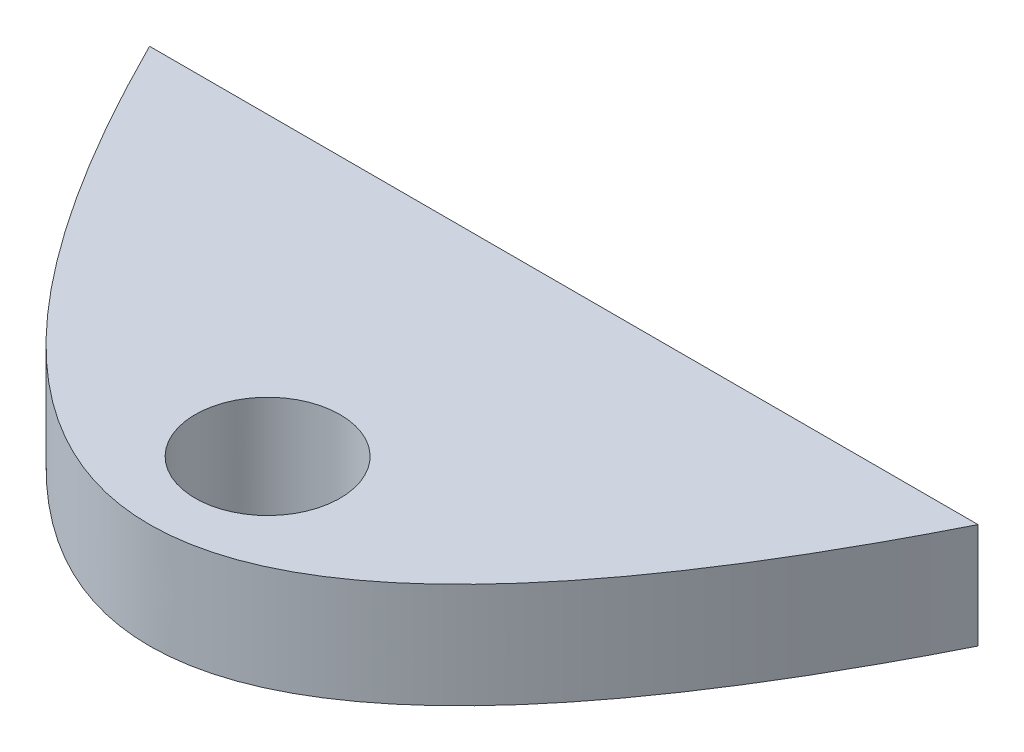
ISO-10303-21;
HEADER;
FILE_DESCRIPTION(('STEP AP214'),'2;1');
FILE_NAME('part.step','',(''),(''),'','','');
FILE_SCHEMA(('AUTOMOTIVE_DESIGN { 1 0 10303 214 1 1 1 1 }'));
ENDSEC;
DATA;
#1=APPLICATION_CONTEXT('core data for automotive mechanical design processes');
#2=APPLICATION_PROTOCOL_DEFINITION('international standard','automotive_design',2000,#1);
#3=PRODUCT_CONTEXT('',#1,'mechanical');
#4=PRODUCT('Part','Part','',(#3));
#5=PRODUCT_RELATED_PRODUCT_CATEGORY('part','',(#4));
#6=PRODUCT_DEFINITION_FORMATION('','',#4);
#7=PRODUCT_DEFINITION_CONTEXT('part definition',#1,'design');
#8=PRODUCT_DEFINITION('design','',#6,#7);
#9=PRODUCT_DEFINITION_SHAPE('','',#8);
#10=(LENGTH_UNIT() NAMED_UNIT(*) SI_UNIT(.MILLI.,.METRE.));
#11=(NAMED_UNIT(*) PLANE_ANGLE_UNIT() SI_UNIT($,.RADIAN.));
#12=(NAMED_UNIT(*) SI_UNIT($,.STERADIAN.) SOLID_ANGLE_UNIT());
#13=UNCERTAINTY_MEASURE_WITH_UNIT(LENGTH_MEASURE(1.E-05),#10,'distance_accuracy_value','');
#14=(GEOMETRIC_REPRESENTATION_CONTEXT(3) GLOBAL_UNCERTAINTY_ASSIGNED_CONTEXT((#13)) GLOBAL_UNIT_ASSIGNED_CONTEXT((#10,
#11,#12)) REPRESENTATION_CONTEXT('',''));
#15=CARTESIAN_POINT('',(0.,0.,0.));
#16=DIRECTION('',(0.,0.,1.));
#17=DIRECTION('',(1.,0.,0.));
#18=AXIS2_PLACEMENT_3D('',#15,#16,#17);
#19=CARTESIAN_POINT('',(0.,473.,142.999999999465));
#20=DIRECTION('',(0.,-1.,0.));
#21=DIRECTION('',(0.,0.,-1.));
#22=AXIS2_PLACEMENT_3D('',#19,#20,#21);
#23=CYLINDRICAL_SURFACE('',#22,35.);
#24=CARTESIAN_POINT('',(0.,249.2,142.999999999465));
#25=DIRECTION('',(0.,1.,0.));
#26=DIRECTION('',(0.,0.,1.));
#27=AXIS2_PLACEMENT_3D('',#24,#25,#26);
#28=CIRCLE('',#27,35.);
#29=CARTESIAN_POINT('',(0.,249.2,177.999999999465));
#30=VERTEX_POINT('',#29);
#31=EDGE_CURVE('E73',#30,#30,#28,.T.);
#32=ORIENTED_EDGE('',*,*,#31,.F.);
#33=EDGE_LOOP('',(#32));
#34=FACE_BOUND('',#33,.T.);
#35=CARTESIAN_POINT('',(0.,300.,142.999999999465));
#36=DIRECTION('',(0.,-1.,0.));
#37=DIRECTION('',(0.,0.,-1.));
#38=AXIS2_PLACEMENT_3D('',#35,#36,#37);
#39=CIRCLE('',#38,35.);
#40=CARTESIAN_POINT('',(0.,300.,107.999999999465));
#41=VERTEX_POINT('',#40);
#42=EDGE_CURVE('E42',#41,#41,#39,.F.);
#43=ORIENTED_EDGE('',*,*,#42,.T.);
#44=EDGE_LOOP('',(#43));
#45=FACE_BOUND('',#44,.T.);
#46=ADVANCED_FACE('F37',(#34,#45),#23,.F.);
#47=CARTESIAN_POINT('',(-200.000000000337,300.,-6.70196537155832E-10));
#48=CARTESIAN_POINT('',(-5.91540705308091E-11,300.,400.000000000552));
#49=CARTESIAN_POINT('',(200.000000000219,300.,-4.34305369445553E-10));
#50=B_SPLINE_CURVE_WITH_KNOTS('',2,(#47,#48,#49),.UNSPECIFIED.,.F.,.F.,(3,3),(0.056028396232078,
0.943971603767659),.UNSPECIFIED.);
#51=DIRECTION('',(0.,-1.,0.));
#52=VECTOR('',#51,1.);
#53=SURFACE_OF_LINEAR_EXTRUSION('',#50,#52);
#54=DIRECTION('',(0.,-1.,0.));
#55=VECTOR('',#54,1.);
#56=CARTESIAN_POINT('',(-200.00000000027,300.,-5.35238059385865E-10));
#57=LINE('',#56,#55);
#58=CARTESIAN_POINT('',(-200.00000000027,300.,-5.35238059385865E-10));
#59=VERTEX_POINT('',#58);
#60=CARTESIAN_POINT('',(-200.00000000027,249.2,-5.35238059385865E-10));
#61=VERTEX_POINT('',#60);
#62=EDGE_CURVE('E47',#59,#61,#57,.T.);
#63=ORIENTED_EDGE('',*,*,#62,.T.);
#64=CARTESIAN_POINT('',(-200.000000000337,249.2,-6.70196537155832E-10));
#65=CARTESIAN_POINT('',(-5.91540705308091E-11,249.2,400.000000000552));
#66=CARTESIAN_POINT('',(200.000000000219,249.2,-4.34305369445553E-10));
#67=B_SPLINE_CURVE_WITH_KNOTS('',2,(#64,#65,#66),.UNSPECIFIED.,.F.,.F.,(3,3),(0.056028396232078,
0.943971603767659),.UNSPECIFIED.);
#68=CARTESIAN_POINT('',(200.000000000156,249.2,0.));
#69=VERTEX_POINT('',#68);
#70=EDGE_CURVE('E53',#61,#69,#67,.T.);
#71=ORIENTED_EDGE('',*,*,#70,.T.);
#72=DIRECTION('',(0.,-1.,0.));
#73=VECTOR('',#72,1.);
#74=CARTESIAN_POINT('',(200.000000000156,300.,-5.35238059385865E-10));
#75=LINE('',#74,#73);
#76=CARTESIAN_POINT('',(200.000000000156,300.,-5.35238059385865E-10));
#77=VERTEX_POINT('',#76);
#78=EDGE_CURVE('E11',#77,#69,#75,.T.);
#79=ORIENTED_EDGE('',*,*,#78,.F.);
#80=EDGE_CURVE('E76',#59,#77,#50,.T.);
#81=ORIENTED_EDGE('',*,*,#80,.F.);
#82=EDGE_LOOP('',(#63,#71,#79,#81));
#83=FACE_BOUND('',#82,.T.);
#84=ADVANCED_FACE('F39',(#83),#53,.F.);
#85=CARTESIAN_POINT('',(-200.00000000027,300.,-5.35238059385865E-10));
#86=DIRECTION('',(0.,0.,1.));
#87=DIRECTION('',(1.,0.,0.));
#88=AXIS2_PLACEMENT_3D('',#85,#86,#87);
#89=PLANE('',#88);
#90=ORIENTED_EDGE('',*,*,#78,.T.);
#91=DIRECTION('',(1.,0.,0.));
#92=VECTOR('',#91,1.);
#93=CARTESIAN_POINT('',(256.798333183654,249.2,0.));
#94=LINE('',#93,#92);
#95=EDGE_CURVE('E65',#61,#69,#94,.T.);
#96=ORIENTED_EDGE('',*,*,#95,.F.);
#97=ORIENTED_EDGE('',*,*,#62,.F.);
#98=DIRECTION('',(-1.,0.,0.));
#99=VECTOR('',#98,1.);
#100=CARTESIAN_POINT('',(-200.00000000027,300.,-5.35238059385865E-10));
#101=LINE('',#100,#99);
#102=EDGE_CURVE('E60',#77,#59,#101,.T.);
#103=ORIENTED_EDGE('',*,*,#102,.F.);
#104=EDGE_LOOP('',(#90,#96,#97,#103));
#105=FACE_BOUND('',#104,.T.);
#106=ADVANCED_FACE('F75',(#105),#89,.F.);
#107=CARTESIAN_POINT('',(-5.9161009424713E-11,300.,200.));
#108=DIRECTION('',(0.,-1.,0.));
#109=DIRECTION('',(0.,0.,-1.));
#110=AXIS2_PLACEMENT_3D('',#107,#108,#109);
#111=PLANE('',#110);
#112=ORIENTED_EDGE('',*,*,#42,.F.);
#113=EDGE_LOOP('',(#112));
#114=FACE_BOUND('',#113,.T.);
#115=ORIENTED_EDGE('',*,*,#80,.T.);
#116=ORIENTED_EDGE('',*,*,#102,.T.);
#117=EDGE_LOOP('',(#115,#116));
#118=FACE_BOUND('',#117,.T.);
#119=ADVANCED_FACE('F78',(#114,#118),#111,.F.);
#120=CARTESIAN_POINT('',(256.798333183654,249.2,300.));
#121=DIRECTION('',(0.,1.,0.));
#122=DIRECTION('',(0.,0.,1.));
#123=AXIS2_PLACEMENT_3D('',#120,#121,#122);
#124=PLANE('',#123);
#125=ORIENTED_EDGE('',*,*,#31,.T.);
#126=EDGE_LOOP('',(#125));
#127=FACE_BOUND('',#126,.T.);
#128=ORIENTED_EDGE('',*,*,#95,.T.);
#129=ORIENTED_EDGE('',*,*,#70,.F.);
#130=EDGE_LOOP('',(#128,#129));
#131=FACE_BOUND('',#130,.T.);
#132=ADVANCED_FACE('F66',(#127,#131),#124,.F.);
#133=CLOSED_SHELL('',(#46,#84,#106,#119,#132));
#134=MANIFOLD_SOLID_BREP('B2',#133);
#135=ADVANCED_BREP_SHAPE_REPRESENTATION('',(#18,#134),#14);
#136=SHAPE_DEFINITION_REPRESENTATION(#9,#135);
ENDSEC;
END-ISO-10303-21;
